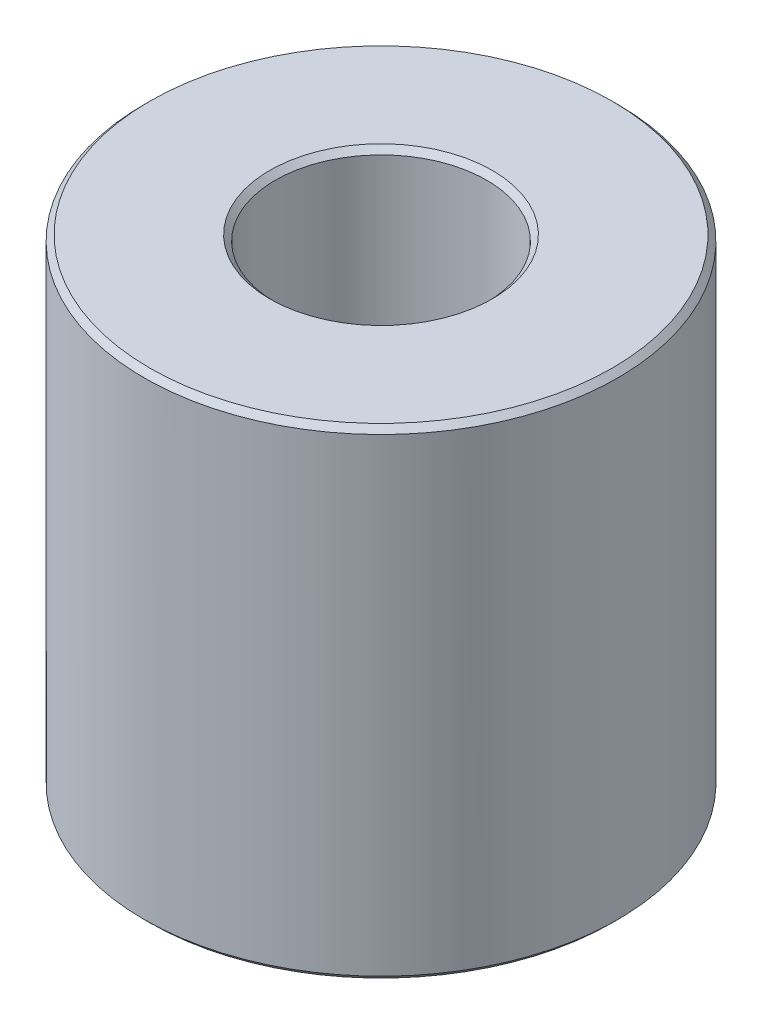
ISO-10303-21;
HEADER;
FILE_DESCRIPTION(('STEP AP214'),'2;1');
FILE_NAME('part.step','',(''),(''),'','','');
FILE_SCHEMA(('AUTOMOTIVE_DESIGN { 1 0 10303 214 1 1 1 1 }'));
ENDSEC;
DATA;
#1=APPLICATION_CONTEXT('core data for automotive mechanical design processes');
#2=APPLICATION_PROTOCOL_DEFINITION('international standard','automotive_design',2000,#1);
#3=PRODUCT_CONTEXT('',#1,'mechanical');
#4=PRODUCT('Part','Part','',(#3));
#5=PRODUCT_RELATED_PRODUCT_CATEGORY('part','',(#4));
#6=PRODUCT_DEFINITION_FORMATION('','',#4);
#7=PRODUCT_DEFINITION_CONTEXT('part definition',#1,'design');
#8=PRODUCT_DEFINITION('design','',#6,#7);
#9=PRODUCT_DEFINITION_SHAPE('','',#8);
#10=(LENGTH_UNIT() NAMED_UNIT(*) SI_UNIT(.MILLI.,.METRE.));
#11=(NAMED_UNIT(*) PLANE_ANGLE_UNIT() SI_UNIT($,.RADIAN.));
#12=(NAMED_UNIT(*) SI_UNIT($,.STERADIAN.) SOLID_ANGLE_UNIT());
#13=UNCERTAINTY_MEASURE_WITH_UNIT(LENGTH_MEASURE(1.E-05),#10,'distance_accuracy_value','');
#14=(GEOMETRIC_REPRESENTATION_CONTEXT(3) GLOBAL_UNCERTAINTY_ASSIGNED_CONTEXT((#13)) GLOBAL_UNIT_ASSIGNED_CONTEXT((#10,
#11,#12)) REPRESENTATION_CONTEXT('',''));
#15=CARTESIAN_POINT('',(0.,0.,0.));
#16=DIRECTION('',(0.,0.,1.));
#17=DIRECTION('',(1.,0.,0.));
#18=AXIS2_PLACEMENT_3D('',#15,#16,#17);
#19=CARTESIAN_POINT('',(0.,70.9918937000788,0.));
#20=DIRECTION('',(0.,-1.,0.));
#21=DIRECTION('',(0.,0.,-1.));
#22=AXIS2_PLACEMENT_3D('',#19,#20,#21);
#23=CYLINDRICAL_SURFACE('',#22,35.);
#24=CARTESIAN_POINT('',(0.,0.834063240033198,0.));
#25=DIRECTION('',(0.,1.,0.));
#26=DIRECTION('',(0.,0.,1.));
#27=AXIS2_PLACEMENT_3D('',#24,#25,#26);
#28=CIRCLE('',#27,35.);
#29=CARTESIAN_POINT('',(0.,0.834063240033198,-35.));
#30=VERTEX_POINT('',#29);
#31=EDGE_CURVE('E10',#30,#30,#28,.T.);
#32=CARTESIAN_POINT('',(0.,70.1578304600456,0.));
#33=DIRECTION('',(0.,1.,0.));
#34=DIRECTION('',(0.,0.,1.));
#35=AXIS2_PLACEMENT_3D('',#32,#33,#34);
#36=CIRCLE('',#35,35.);
#37=CARTESIAN_POINT('',(0.,70.1578304600456,-35.));
#38=VERTEX_POINT('',#37);
#39=EDGE_CURVE('E50',#38,#38,#36,.F.);
#40=CARTESIAN_POINT('',(0.,0.834063240033198,-35.));
#41=CARTESIAN_POINT('',(0.,1.55618581524166,-35.));
#42=CARTESIAN_POINT('',(0.,2.27830839045012,-35.));
#43=CARTESIAN_POINT('',(0.,3.72255354086704,-35.));
#44=CARTESIAN_POINT('',(0.,4.44467611607551,-35.));
#45=CARTESIAN_POINT('',(0.,5.88892126649244,-35.));
#46=CARTESIAN_POINT('',(0.,6.6110438417009,-35.));
#47=CARTESIAN_POINT('',(0.,8.05528899211782,-35.));
#48=CARTESIAN_POINT('',(0.,8.77741156732629,-35.));
#49=CARTESIAN_POINT('',(0.,10.2216567177432,-35.));
#50=CARTESIAN_POINT('',(0.,10.9437792929517,-35.));
#51=CARTESIAN_POINT('',(0.,12.3880244433686,-35.));
#52=CARTESIAN_POINT('',(0.,13.1101470185771,-35.));
#53=CARTESIAN_POINT('',(0.,14.554392168994,-35.));
#54=CARTESIAN_POINT('',(0.,15.2765147442024,-35.));
#55=CARTESIAN_POINT('',(0.,16.7207598946194,-35.));
#56=CARTESIAN_POINT('',(0.,17.4428824698278,-35.));
#57=CARTESIAN_POINT('',(0.,18.8871276202448,-35.));
#58=CARTESIAN_POINT('',(0.,19.6092501954532,-35.));
#59=CARTESIAN_POINT('',(0.,21.0534953458702,-35.));
#60=CARTESIAN_POINT('',(0.,21.7756179210786,-35.));
#61=CARTESIAN_POINT('',(0.,23.2198630714955,-35.));
#62=CARTESIAN_POINT('',(0.,23.941985646704,-35.));
#63=CARTESIAN_POINT('',(0.,25.3862307971209,-35.));
#64=CARTESIAN_POINT('',(0.,26.1083533723294,-35.));
#65=CARTESIAN_POINT('',(0.,27.5525985227463,-35.));
#66=CARTESIAN_POINT('',(0.,28.2747210979548,-35.));
#67=CARTESIAN_POINT('',(0.,29.7189662483717,-35.));
#68=CARTESIAN_POINT('',(0.,30.4410888235802,-35.));
#69=CARTESIAN_POINT('',(0.,31.8853339739971,-35.));
#70=CARTESIAN_POINT('',(0.,32.6074565492056,-35.));
#71=CARTESIAN_POINT('',(0.,34.0517016996225,-35.));
#72=CARTESIAN_POINT('',(0.,34.7738242748309,-35.));
#73=CARTESIAN_POINT('',(0.,36.2180694252479,-35.));
#74=CARTESIAN_POINT('',(0.,36.9401920004563,-35.));
#75=CARTESIAN_POINT('',(0.,38.3844371508733,-35.));
#76=CARTESIAN_POINT('',(0.,39.1065597260817,-35.));
#77=CARTESIAN_POINT('',(0.,40.5508048764986,-35.));
#78=CARTESIAN_POINT('',(0.,41.2729274517071,-35.));
#79=CARTESIAN_POINT('',(0.,42.717172602124,-35.));
#80=CARTESIAN_POINT('',(0.,43.4392951773325,-35.));
#81=CARTESIAN_POINT('',(0.,44.8835403277494,-35.));
#82=CARTESIAN_POINT('',(0.,45.6056629029579,-35.));
#83=CARTESIAN_POINT('',(0.,47.0499080533748,-35.));
#84=CARTESIAN_POINT('',(0.,47.7720306285833,-35.));
#85=CARTESIAN_POINT('',(0.,49.2162757790002,-35.));
#86=CARTESIAN_POINT('',(0.,49.9383983542087,-35.));
#87=CARTESIAN_POINT('',(0.,51.3826435046256,-35.));
#88=CARTESIAN_POINT('',(0.,52.104766079834,-35.));
#89=CARTESIAN_POINT('',(0.,53.549011230251,-35.));
#90=CARTESIAN_POINT('',(0.,54.2711338054594,-35.));
#91=CARTESIAN_POINT('',(0.,55.7153789558764,-35.));
#92=CARTESIAN_POINT('',(0.,56.4375015310848,-35.));
#93=CARTESIAN_POINT('',(0.,57.8817466815017,-35.));
#94=CARTESIAN_POINT('',(0.,58.6038692567102,-35.));
#95=CARTESIAN_POINT('',(0.,60.0481144071271,-35.));
#96=CARTESIAN_POINT('',(0.,60.7702369823356,-35.));
#97=CARTESIAN_POINT('',(0.,62.2144821327525,-35.));
#98=CARTESIAN_POINT('',(0.,62.936604707961,-35.));
#99=CARTESIAN_POINT('',(0.,64.3808498583779,-35.));
#100=CARTESIAN_POINT('',(0.,65.1029724335864,-35.));
#101=CARTESIAN_POINT('',(0.,66.5472175840033,-35.));
#102=CARTESIAN_POINT('',(0.,67.2693401592118,-35.));
#103=CARTESIAN_POINT('',(0.,68.7135853096287,-35.));
#104=CARTESIAN_POINT('',(0.,69.4357078848371,-35.));
#105=CARTESIAN_POINT('',(0.,70.1578304600456,-35.));
#106=B_SPLINE_CURVE_WITH_KNOTS('',3,(#40,#41,#42,#43,#44,#45,#46,#47,#48,#49,#50,#51,#52,#53,
#54,#55,#56,#57,#58,#59,#60,#61,#62,#63,#64,#65,#66,#67,#68,#69,#70,#71,#72,#73,#74,#75,#76,#77,
#78,#79,#80,#81,#82,#83,#84,#85,#86,#87,#88,#89,#90,#91,#92,#93,#94,#95,#96,#97,#98,#99,#100,
#101,#102,#103,#104,#105),.UNSPECIFIED.,.F.,.F.,(4,2,2,2,2,2,2,2,2,2,2,2,2,2,2,2,2,2,2,2,2,2,2,
2,2,2,2,2,2,2,2,2,4),(0.,2.16636772562538,4.33273545125078,6.49910317687616,8.66547090250155,
10.8318386281269,12.9982063537523,15.1645740793777,17.3309418050031,19.4973095306285,
21.6636772562539,23.8300449818793,25.9964127075046,28.16278043313,30.3291481587554,
32.4955158843808,34.6618836100062,36.8282513356316,38.994619061257,41.1609867868824,
43.3273545125078,45.4937222381331,47.6600899637585,49.8264576893839,51.9928254150093,
54.1591931406347,56.3255608662601,58.4919285918855,60.6582963175109,62.8246640431362,
64.9910317687616,67.157399494387,69.3237672200124),.UNSPECIFIED.);
#107=EDGE_CURVE('BSEAM39',#30,#38,#106,.T.);
#108=ORIENTED_EDGE('',*,*,#31,.T.);
#109=ORIENTED_EDGE('',*,*,#39,.T.);
#110=ORIENTED_EDGE('',*,*,#107,.T.);
#111=ORIENTED_EDGE('',*,*,#107,.F.);
#112=EDGE_LOOP('',(#108,#110,#109,#111));
#113=FACE_BOUND('',#112,.T.);
#114=ADVANCED_FACE('F39',(#113),#23,.T.);
#115=CARTESIAN_POINT('',(0.,70.9918937000788,0.));
#116=DIRECTION('',(0.,1.,0.));
#117=DIRECTION('',(0.,0.,1.));
#118=AXIS2_PLACEMENT_3D('',#115,#116,#117);
#119=PLANE('',#118);
#120=CARTESIAN_POINT('',(0.,70.9918937000788,0.));
#121=DIRECTION('',(0.,1.,0.));
#122=DIRECTION('',(0.,0.,1.));
#123=AXIS2_PLACEMENT_3D('',#120,#121,#122);
#124=CIRCLE('',#123,16.4523740095208);
#125=CARTESIAN_POINT('',(0.,70.9918937000788,16.4523740095208));
#126=VERTEX_POINT('',#125);
#127=EDGE_CURVE('E58',#126,#126,#124,.F.);
#128=ORIENTED_EDGE('',*,*,#127,.T.);
#129=EDGE_LOOP('',(#128));
#130=FACE_BOUND('',#129,.T.);
#131=CARTESIAN_POINT('',(0.,70.9918937000788,0.));
#132=DIRECTION('',(0.,1.,0.));
#133=DIRECTION('',(0.,0.,1.));
#134=AXIS2_PLACEMENT_3D('',#131,#132,#133);
#135=CIRCLE('',#134,34.1659367599668);
#136=CARTESIAN_POINT('',(0.,70.9918937000788,-34.1659367599668));
#137=VERTEX_POINT('',#136);
#138=EDGE_CURVE('E61',#137,#137,#135,.T.);
#139=ORIENTED_EDGE('',*,*,#138,.T.);
#140=EDGE_LOOP('',(#139));
#141=FACE_BOUND('',#140,.T.);
#142=ADVANCED_FACE('F88',(#130,#141),#119,.T.);
#143=CARTESIAN_POINT('',(0.,0.,0.));
#144=DIRECTION('',(0.,1.,0.));
#145=DIRECTION('',(0.,0.,1.));
#146=AXIS2_PLACEMENT_3D('',#143,#144,#145);
#147=PLANE('',#146);
#148=CARTESIAN_POINT('',(0.,0.,0.));
#149=DIRECTION('',(0.,1.,0.));
#150=DIRECTION('',(0.,0.,1.));
#151=AXIS2_PLACEMENT_3D('',#148,#149,#150);
#152=CIRCLE('',#151,16.4523740095208);
#153=CARTESIAN_POINT('',(0.,0.,16.4523740095208));
#154=VERTEX_POINT('',#153);
#155=EDGE_CURVE('E51',#154,#154,#152,.T.);
#156=ORIENTED_EDGE('',*,*,#155,.T.);
#157=EDGE_LOOP('',(#156));
#158=FACE_BOUND('',#157,.T.);
#159=CARTESIAN_POINT('',(0.,0.,0.));
#160=DIRECTION('',(0.,1.,0.));
#161=DIRECTION('',(0.,0.,1.));
#162=AXIS2_PLACEMENT_3D('',#159,#160,#161);
#163=CIRCLE('',#162,34.1659367599668);
#164=CARTESIAN_POINT('',(0.,0.,34.1659367599668));
#165=VERTEX_POINT('',#164);
#166=EDGE_CURVE('E54',#165,#165,#163,.F.);
#167=ORIENTED_EDGE('',*,*,#166,.T.);
#168=EDGE_LOOP('',(#167));
#169=FACE_BOUND('',#168,.T.);
#170=ADVANCED_FACE('F83',(#158,#169),#147,.F.);
#171=CARTESIAN_POINT('',(0.,70.9918937000788,0.));
#172=DIRECTION('',(0.,-1.,0.));
#173=DIRECTION('',(0.,0.,-1.));
#174=AXIS2_PLACEMENT_3D('',#171,#172,#173);
#175=CYLINDRICAL_SURFACE('',#174,15.6183107694876);
#176=CARTESIAN_POINT('',(0.,70.1578304600456,0.));
#177=DIRECTION('',(0.,1.,0.));
#178=DIRECTION('',(0.,0.,1.));
#179=AXIS2_PLACEMENT_3D('',#176,#177,#178);
#180=CIRCLE('',#179,15.6183107694876);
#181=CARTESIAN_POINT('',(0.,70.1578304600456,15.6183107694876));
#182=VERTEX_POINT('',#181);
#183=EDGE_CURVE('E67',#182,#182,#180,.T.);
#184=ORIENTED_EDGE('',*,*,#183,.T.);
#185=EDGE_LOOP('',(#184));
#186=FACE_BOUND('',#185,.T.);
#187=CARTESIAN_POINT('',(0.,0.834063240033225,0.));
#188=DIRECTION('',(0.,1.,0.));
#189=DIRECTION('',(0.,0.,1.));
#190=AXIS2_PLACEMENT_3D('',#187,#188,#189);
#191=CIRCLE('',#190,15.6183107694876);
#192=CARTESIAN_POINT('',(0.,0.834063240033225,15.6183107694876));
#193=VERTEX_POINT('',#192);
#194=EDGE_CURVE('E69',#193,#193,#191,.F.);
#195=ORIENTED_EDGE('',*,*,#194,.T.);
#196=EDGE_LOOP('',(#195));
#197=FACE_BOUND('',#196,.T.);
#198=ADVANCED_FACE('F71',(#186,#197),#175,.F.);
#199=CARTESIAN_POINT('',(0.,70.1578304600456,0.));
#200=DIRECTION('',(0.,1.,0.));
#201=DIRECTION('',(0.,0.,1.));
#202=AXIS2_PLACEMENT_3D('',#199,#200,#201);
#203=CONICAL_SURFACE('',#202,15.6183107694876,0.785398163397445);
#204=ORIENTED_EDGE('',*,*,#127,.F.);
#205=EDGE_LOOP('',(#204));
#206=FACE_BOUND('',#205,.T.);
#207=ORIENTED_EDGE('',*,*,#183,.F.);
#208=EDGE_LOOP('',(#207));
#209=FACE_BOUND('',#208,.T.);
#210=ADVANCED_FACE('F77',(#206,#209),#203,.F.);
#211=CARTESIAN_POINT('',(0.,0.,0.));
#212=DIRECTION('',(0.,-1.,0.));
#213=DIRECTION('',(0.,0.,-1.));
#214=AXIS2_PLACEMENT_3D('',#211,#212,#213);
#215=CONICAL_SURFACE('',#214,16.4523740095208,0.785398163397445);
#216=ORIENTED_EDGE('',*,*,#194,.F.);
#217=EDGE_LOOP('',(#216));
#218=FACE_BOUND('',#217,.T.);
#219=ORIENTED_EDGE('',*,*,#155,.F.);
#220=EDGE_LOOP('',(#219));
#221=FACE_BOUND('',#220,.T.);
#222=ADVANCED_FACE('F73',(#218,#221),#215,.F.);
#223=CARTESIAN_POINT('',(0.,0.834063240033198,0.));
#224=DIRECTION('',(0.,1.,0.));
#225=DIRECTION('',(0.,0.,1.));
#226=AXIS2_PLACEMENT_3D('',#223,#224,#225);
#227=CONICAL_SURFACE('',#226,35.,0.785398163397452);
#228=ORIENTED_EDGE('',*,*,#166,.F.);
#229=EDGE_LOOP('',(#228));
#230=FACE_BOUND('',#229,.T.);
#231=ORIENTED_EDGE('',*,*,#31,.F.);
#232=EDGE_LOOP('',(#231));
#233=FACE_BOUND('',#232,.T.);
#234=ADVANCED_FACE('F76',(#230,#233),#227,.T.);
#235=CARTESIAN_POINT('',(0.,70.9918937000788,0.));
#236=DIRECTION('',(0.,-1.,0.));
#237=DIRECTION('',(0.,0.,-1.));
#238=AXIS2_PLACEMENT_3D('',#235,#236,#237);
#239=CONICAL_SURFACE('',#238,34.1659367599668,0.785398163397444);
#240=CARTESIAN_POINT('',(0.,70.1578304600456,-35.));
#241=CARTESIAN_POINT('',(0.,70.166518618796,-34.9913118412497));
#242=CARTESIAN_POINT('',(0.,70.1752067775463,-34.9826236824993));
#243=CARTESIAN_POINT('',(0.,70.192583095047,-34.9652473649986));
#244=CARTESIAN_POINT('',(0.,70.2012712537973,-34.9565592062483));
#245=CARTESIAN_POINT('',(0.,70.218647571298,-34.9391828887476));
#246=CARTESIAN_POINT('',(0.,70.2273357300484,-34.9304947299972));
#247=CARTESIAN_POINT('',(0.,70.2447120475491,-34.9131184124966));
#248=CARTESIAN_POINT('',(0.,70.2534002062994,-34.9044302537462));
#249=CARTESIAN_POINT('',(0.,70.2707765238001,-34.8870539362455));
#250=CARTESIAN_POINT('',(0.,70.2794646825504,-34.8783657774952));
#251=CARTESIAN_POINT('',(0.,70.2968410000511,-34.8609894599945));
#252=CARTESIAN_POINT('',(0.,70.3055291588015,-34.8523013012441));
#253=CARTESIAN_POINT('',(0.,70.3229054763022,-34.8349249837434));
#254=CARTESIAN_POINT('',(0.,70.3315936350525,-34.8262368249931));
#255=CARTESIAN_POINT('',(0.,70.3489699525532,-34.8088605074924));
#256=CARTESIAN_POINT('',(0.,70.3576581113036,-34.8001723487421));
#257=CARTESIAN_POINT('',(0.,70.3750344288043,-34.7827960312414));
#258=CARTESIAN_POINT('',(0.,70.3837225875546,-34.774107872491));
#259=CARTESIAN_POINT('',(0.,70.4010989050553,-34.7567315549903));
#260=CARTESIAN_POINT('',(0.,70.4097870638056,-34.74804339624));
#261=CARTESIAN_POINT('',(0.,70.4271633813063,-34.7306670787393));
#262=CARTESIAN_POINT('',(0.,70.4358515400567,-34.721978919989));
#263=CARTESIAN_POINT('',(0.,70.4532278575574,-34.7046026024883));
#264=CARTESIAN_POINT('',(0.,70.4619160163077,-34.6959144437379));
#265=CARTESIAN_POINT('',(0.,70.4792923338084,-34.6785381262372));
#266=CARTESIAN_POINT('',(0.,70.4879804925587,-34.6698499674869));
#267=CARTESIAN_POINT('',(0.,70.5053568100594,-34.6524736499862));
#268=CARTESIAN_POINT('',(0.,70.5140449688098,-34.6437854912358));
#269=CARTESIAN_POINT('',(0.,70.5314212863105,-34.6264091737351));
#270=CARTESIAN_POINT('',(0.,70.5401094450608,-34.6177210149848));
#271=CARTESIAN_POINT('',(0.,70.5574857625615,-34.6003446974841));
#272=CARTESIAN_POINT('',(0.,70.5661739213119,-34.5916565387338));
#273=CARTESIAN_POINT('',(0.,70.5835502388125,-34.5742802212331));
#274=CARTESIAN_POINT('',(0.,70.5922383975629,-34.5655920624827));
#275=CARTESIAN_POINT('',(0.,70.6096147150636,-34.548215744982));
#276=CARTESIAN_POINT('',(0.,70.6183028738139,-34.5395275862317));
#277=CARTESIAN_POINT('',(0.,70.6356791913146,-34.522151268731));
#278=CARTESIAN_POINT('',(0.,70.644367350065,-34.5134631099807));
#279=CARTESIAN_POINT('',(0.,70.6617436675657,-34.49608679248));
#280=CARTESIAN_POINT('',(0.,70.670431826316,-34.4873986337296));
#281=CARTESIAN_POINT('',(0.,70.6878081438167,-34.4700223162289));
#282=CARTESIAN_POINT('',(0.,70.6964963025671,-34.4613341574786));
#283=CARTESIAN_POINT('',(0.,70.7138726200677,-34.4439578399779));
#284=CARTESIAN_POINT('',(0.,70.7225607788181,-34.4352696812275));
#285=CARTESIAN_POINT('',(0.,70.7399370963188,-34.4178933637269));
#286=CARTESIAN_POINT('',(0.,70.7486252550691,-34.4092052049765));
#287=CARTESIAN_POINT('',(0.,70.7660015725698,-34.3918288874758));
#288=CARTESIAN_POINT('',(0.,70.7746897313202,-34.3831407287255));
#289=CARTESIAN_POINT('',(0.,70.7920660488209,-34.3657644112248));
#290=CARTESIAN_POINT('',(0.,70.8007542075712,-34.3570762524744));
#291=CARTESIAN_POINT('',(0.,70.8181305250719,-34.3396999349737));
#292=CARTESIAN_POINT('',(0.,70.8268186838222,-34.3310117762234));
#293=CARTESIAN_POINT('',(0.,70.8441950013229,-34.3136354587227));
#294=CARTESIAN_POINT('',(0.,70.8528831600733,-34.3049472999724));
#295=CARTESIAN_POINT('',(0.,70.870259477574,-34.2875709824717));
#296=CARTESIAN_POINT('',(0.,70.8789476363243,-34.2788828237213));
#297=CARTESIAN_POINT('',(0.,70.896323953825,-34.2615065062206));
#298=CARTESIAN_POINT('',(0.,70.9050121125753,-34.2528183474703));
#299=CARTESIAN_POINT('',(0.,70.922388430076,-34.2354420299696));
#300=CARTESIAN_POINT('',(0.,70.9310765888264,-34.2267538712192));
#301=CARTESIAN_POINT('',(0.,70.9484529063271,-34.2093775537186));
#302=CARTESIAN_POINT('',(0.,70.9571410650774,-34.2006893949682));
#303=CARTESIAN_POINT('',(0.,70.9745173825781,-34.1833130774675));
#304=CARTESIAN_POINT('',(0.,70.9832055413285,-34.1746249187172));
#305=CARTESIAN_POINT('',(0.,70.9918937000788,-34.1659367599668));
#306=B_SPLINE_CURVE_WITH_KNOTS('',3,(#240,#241,#242,#243,#244,#245,#246,#247,#248,#249,#250,
#251,#252,#253,#254,#255,#256,#257,#258,#259,#260,#261,#262,#263,#264,#265,#266,#267,#268,#269,
#270,#271,#272,#273,#274,#275,#276,#277,#278,#279,#280,#281,#282,#283,#284,#285,#286,#287,#288,
#289,#290,#291,#292,#293,#294,#295,#296,#297,#298,#299,#300,#301,#302,#303,#304,#305),
.UNSPECIFIED.,.F.,.F.,(4,2,2,2,2,2,2,2,2,2,2,2,2,2,2,2,2,2,2,2,2,2,2,2,2,2,2,2,2,2,2,2,4),(0.,
0.0368607358103741,0.0737214716207384,0.110582207431112,0.147442943241477,0.184303679051846,
0.22116441486221,0.258025150672584,0.294885886482949,0.331746622293323,0.368607358103687,
0.405468093914061,0.442328829724425,0.4791895655348,0.516050301345164,0.552911037155538,
0.589771772965897,0.626632508776262,0.663493244586636,0.700353980397,0.737214716207374,
0.774075452017738,0.810936187828112,0.847796923638476,0.884657659448851,0.921518395259215,
0.958379131069589,0.995239866879948,1.03210060269032,1.06896133850069,1.10582207431106,
1.14268281012143,1.1795435459318),.UNSPECIFIED.);
#307=EDGE_CURVE('BSEAM45',#38,#137,#306,.T.);
#308=ORIENTED_EDGE('',*,*,#39,.F.);
#309=ORIENTED_EDGE('',*,*,#138,.F.);
#310=ORIENTED_EDGE('',*,*,#307,.T.);
#311=ORIENTED_EDGE('',*,*,#307,.F.);
#312=EDGE_LOOP('',(#308,#310,#309,#311));
#313=FACE_BOUND('',#312,.T.);
#314=ADVANCED_FACE('F45',(#313),#239,.T.);
#315=CLOSED_SHELL('',(#114,#142,#170,#198,#210,#222,#234,#314));
#316=MANIFOLD_SOLID_BREP('B2',#315);
#317=ADVANCED_BREP_SHAPE_REPRESENTATION('',(#18,#316),#14);
#318=SHAPE_DEFINITION_REPRESENTATION(#9,#317);
ENDSEC;
END-ISO-10303-21;
